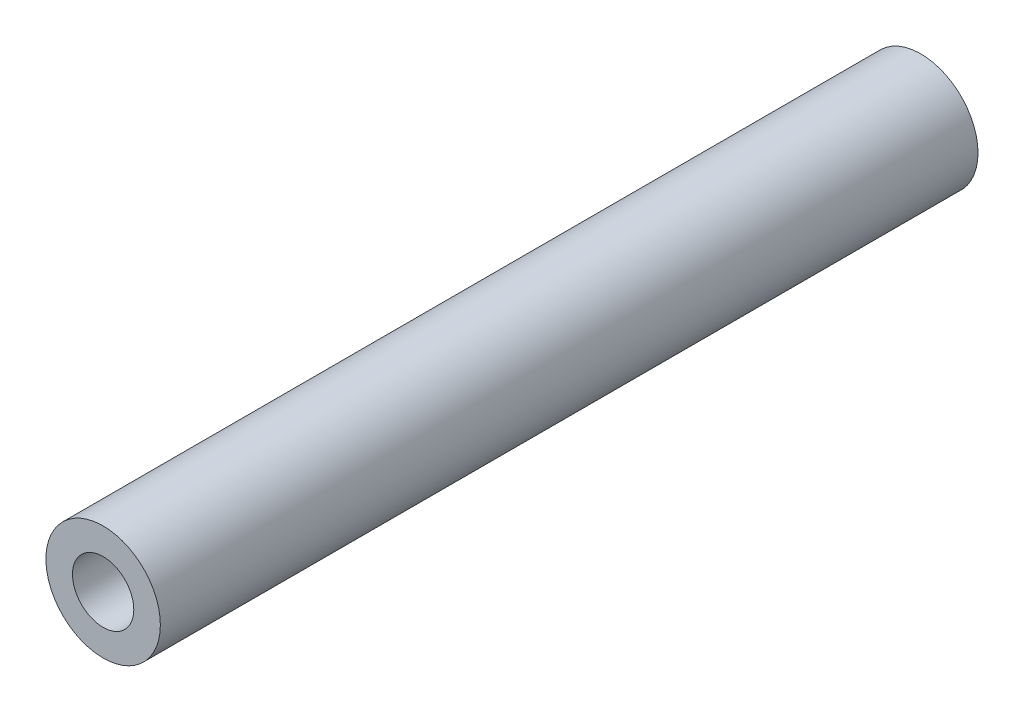
ISO-10303-21;
HEADER;
FILE_DESCRIPTION(('STEP AP214'),'2;1');
FILE_NAME('part.step','',(''),(''),'','','');
FILE_SCHEMA(('AUTOMOTIVE_DESIGN { 1 0 10303 214 1 1 1 1 }'));
ENDSEC;
DATA;
#1=APPLICATION_CONTEXT('core data for automotive mechanical design processes');
#2=APPLICATION_PROTOCOL_DEFINITION('international standard','automotive_design',2000,#1);
#3=PRODUCT_CONTEXT('',#1,'mechanical');
#4=PRODUCT('Part','Part','',(#3));
#5=PRODUCT_RELATED_PRODUCT_CATEGORY('part','',(#4));
#6=PRODUCT_DEFINITION_FORMATION('','',#4);
#7=PRODUCT_DEFINITION_CONTEXT('part definition',#1,'design');
#8=PRODUCT_DEFINITION('design','',#6,#7);
#9=PRODUCT_DEFINITION_SHAPE('','',#8);
#10=(LENGTH_UNIT() NAMED_UNIT(*) SI_UNIT(.MILLI.,.METRE.));
#11=(NAMED_UNIT(*) PLANE_ANGLE_UNIT() SI_UNIT($,.RADIAN.));
#12=(NAMED_UNIT(*) SI_UNIT($,.STERADIAN.) SOLID_ANGLE_UNIT());
#13=UNCERTAINTY_MEASURE_WITH_UNIT(LENGTH_MEASURE(1.E-05),#10,'distance_accuracy_value','');
#14=(GEOMETRIC_REPRESENTATION_CONTEXT(3) GLOBAL_UNCERTAINTY_ASSIGNED_CONTEXT((#13)) GLOBAL_UNIT_ASSIGNED_CONTEXT((#10,
#11,#12)) REPRESENTATION_CONTEXT('',''));
#15=CARTESIAN_POINT('',(0.,0.,0.));
#16=DIRECTION('',(0.,0.,1.));
#17=DIRECTION('',(1.,0.,0.));
#18=AXIS2_PLACEMENT_3D('',#15,#16,#17);
#19=CARTESIAN_POINT('',(0.,0.,0.));
#20=DIRECTION('',(0.,0.,1.));
#21=DIRECTION('',(1.,0.,0.));
#22=AXIS2_PLACEMENT_3D('',#19,#20,#21);
#23=PLANE('',#22);
#24=CARTESIAN_POINT('',(0.,0.,0.));
#25=DIRECTION('',(0.,0.,1.));
#26=DIRECTION('',(1.,0.,0.));
#27=AXIS2_PLACEMENT_3D('',#24,#25,#26);
#28=CIRCLE('',#27,2.8);
#29=CARTESIAN_POINT('',(2.8,0.,0.));
#30=VERTEX_POINT('',#29);
#31=EDGE_CURVE('E37',#30,#30,#28,.T.);
#32=ORIENTED_EDGE('',*,*,#31,.F.);
#33=EDGE_LOOP('',(#32));
#34=FACE_BOUND('',#33,.T.);
#35=CARTESIAN_POINT('',(0.,0.,0.));
#36=DIRECTION('',(0.,0.,1.));
#37=DIRECTION('',(1.,0.,0.));
#38=AXIS2_PLACEMENT_3D('',#35,#36,#37);
#39=CIRCLE('',#38,1.5);
#40=CARTESIAN_POINT('',(1.5,0.,0.));
#41=VERTEX_POINT('',#40);
#42=EDGE_CURVE('E41',#41,#41,#39,.T.);
#43=ORIENTED_EDGE('',*,*,#42,.T.);
#44=EDGE_LOOP('',(#43));
#45=FACE_BOUND('',#44,.T.);
#46=ADVANCED_FACE('F30',(#34,#45),#23,.F.);
#47=CARTESIAN_POINT('',(0.,0.,5.));
#48=DIRECTION('',(0.,0.,-1.));
#49=DIRECTION('',(-1.,0.,0.));
#50=AXIS2_PLACEMENT_3D('',#47,#48,#49);
#51=CYLINDRICAL_SURFACE('',#50,2.8);
#52=ORIENTED_EDGE('',*,*,#31,.T.);
#53=EDGE_LOOP('',(#52));
#54=FACE_BOUND('',#53,.T.);
#55=CARTESIAN_POINT('',(0.,0.,40.));
#56=DIRECTION('',(0.,0.,1.));
#57=DIRECTION('',(1.,0.,0.));
#58=AXIS2_PLACEMENT_3D('',#55,#56,#57);
#59=CIRCLE('',#58,2.8);
#60=CARTESIAN_POINT('',(2.8,0.,40.));
#61=VERTEX_POINT('',#60);
#62=EDGE_CURVE('E50',#61,#61,#59,.T.);
#63=ORIENTED_EDGE('',*,*,#62,.F.);
#64=EDGE_LOOP('',(#63));
#65=FACE_BOUND('',#64,.T.);
#66=ADVANCED_FACE('F32',(#54,#65),#51,.T.);
#67=CARTESIAN_POINT('',(0.,0.,5.));
#68=DIRECTION('',(0.,0.,-1.));
#69=DIRECTION('',(-1.,0.,0.));
#70=AXIS2_PLACEMENT_3D('',#67,#68,#69);
#71=CYLINDRICAL_SURFACE('',#70,1.5);
#72=CARTESIAN_POINT('',(0.,0.,5.));
#73=DIRECTION('',(0.,0.,1.));
#74=DIRECTION('',(1.,0.,0.));
#75=AXIS2_PLACEMENT_3D('',#72,#73,#74);
#76=CIRCLE('',#75,1.5);
#77=CARTESIAN_POINT('',(1.5,0.,5.));
#78=VERTEX_POINT('',#77);
#79=EDGE_CURVE('E45',#78,#78,#76,.T.);
#80=ORIENTED_EDGE('',*,*,#79,.T.);
#81=EDGE_LOOP('',(#80));
#82=FACE_BOUND('',#81,.T.);
#83=ORIENTED_EDGE('',*,*,#42,.F.);
#84=EDGE_LOOP('',(#83));
#85=FACE_BOUND('',#84,.T.);
#86=ADVANCED_FACE('F70',(#82,#85),#71,.F.);
#87=CARTESIAN_POINT('',(0.,0.,5.));
#88=DIRECTION('',(0.,0.,1.));
#89=DIRECTION('',(1.,0.,0.));
#90=AXIS2_PLACEMENT_3D('',#87,#88,#89);
#91=PLANE('',#90);
#92=ORIENTED_EDGE('',*,*,#79,.F.);
#93=EDGE_LOOP('',(#92));
#94=FACE_BOUND('',#93,.T.);
#95=ADVANCED_FACE('F61',(#94),#91,.F.);
#96=CARTESIAN_POINT('',(0.,0.,40.));
#97=DIRECTION('',(0.,0.,1.));
#98=DIRECTION('',(1.,0.,0.));
#99=AXIS2_PLACEMENT_3D('',#96,#97,#98);
#100=PLANE('',#99);
#101=ORIENTED_EDGE('',*,*,#62,.T.);
#102=EDGE_LOOP('',(#101));
#103=FACE_BOUND('',#102,.T.);
#104=CARTESIAN_POINT('',(0.,0.,40.));
#105=DIRECTION('',(0.,0.,1.));
#106=DIRECTION('',(1.,0.,0.));
#107=AXIS2_PLACEMENT_3D('',#104,#105,#106);
#108=CIRCLE('',#107,1.5);
#109=CARTESIAN_POINT('',(1.5,0.,40.));
#110=VERTEX_POINT('',#109);
#111=EDGE_CURVE('E53',#110,#110,#108,.T.);
#112=ORIENTED_EDGE('',*,*,#111,.F.);
#113=EDGE_LOOP('',(#112));
#114=FACE_BOUND('',#113,.T.);
#115=ADVANCED_FACE('F59',(#103,#114),#100,.T.);
#116=CARTESIAN_POINT('',(0.,0.,40.));
#117=DIRECTION('',(0.,0.,-1.));
#118=DIRECTION('',(-1.,0.,0.));
#119=AXIS2_PLACEMENT_3D('',#116,#117,#118);
#120=CYLINDRICAL_SURFACE('',#119,1.5);
#121=ORIENTED_EDGE('',*,*,#111,.T.);
#122=EDGE_LOOP('',(#121));
#123=FACE_BOUND('',#122,.T.);
#124=CARTESIAN_POINT('',(0.,0.,35.));
#125=DIRECTION('',(0.,0.,1.));
#126=DIRECTION('',(1.,0.,0.));
#127=AXIS2_PLACEMENT_3D('',#124,#125,#126);
#128=CIRCLE('',#127,1.5);
#129=CARTESIAN_POINT('',(1.5,0.,35.));
#130=VERTEX_POINT('',#129);
#131=EDGE_CURVE('E10',#130,#130,#128,.F.);
#132=ORIENTED_EDGE('',*,*,#131,.T.);
#133=EDGE_LOOP('',(#132));
#134=FACE_BOUND('',#133,.T.);
#135=ADVANCED_FACE('F57',(#123,#134),#120,.F.);
#136=CARTESIAN_POINT('',(0.,0.,35.));
#137=DIRECTION('',(0.,0.,1.));
#138=DIRECTION('',(1.,0.,0.));
#139=AXIS2_PLACEMENT_3D('',#136,#137,#138);
#140=PLANE('',#139);
#141=ORIENTED_EDGE('',*,*,#131,.F.);
#142=EDGE_LOOP('',(#141));
#143=FACE_BOUND('',#142,.T.);
#144=ADVANCED_FACE('F68',(#143),#140,.T.);
#145=CLOSED_SHELL('',(#46,#66,#86,#95,#115,#135,#144));
#146=MANIFOLD_SOLID_BREP('B2',#145);
#147=ADVANCED_BREP_SHAPE_REPRESENTATION('',(#18,#146),#14);
#148=SHAPE_DEFINITION_REPRESENTATION(#9,#147);
ENDSEC;
END-ISO-10303-21;
